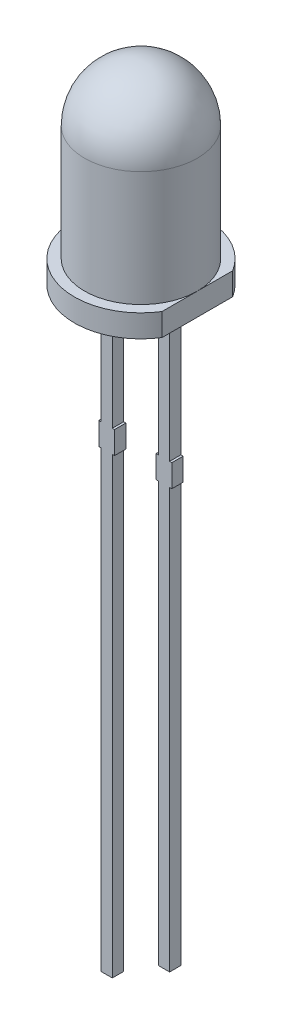
ISO-10303-21;
HEADER;
FILE_DESCRIPTION(('STEP AP214'),'2;1');
FILE_NAME('part.step','',(''),(''),'','','');
FILE_SCHEMA(('AUTOMOTIVE_DESIGN { 1 0 10303 214 1 1 1 1 }'));
ENDSEC;
DATA;
#1=APPLICATION_CONTEXT('core data for automotive mechanical design processes');
#2=APPLICATION_PROTOCOL_DEFINITION('international standard','automotive_design',2000,#1);
#3=PRODUCT_CONTEXT('',#1,'mechanical');
#4=PRODUCT('Part','Part','',(#3));
#5=PRODUCT_RELATED_PRODUCT_CATEGORY('part','',(#4));
#6=PRODUCT_DEFINITION_FORMATION('','',#4);
#7=PRODUCT_DEFINITION_CONTEXT('part definition',#1,'design');
#8=PRODUCT_DEFINITION('design','',#6,#7);
#9=PRODUCT_DEFINITION_SHAPE('','',#8);
#10=(LENGTH_UNIT() NAMED_UNIT(*) SI_UNIT(.MILLI.,.METRE.));
#11=(NAMED_UNIT(*) PLANE_ANGLE_UNIT() SI_UNIT($,.RADIAN.));
#12=(NAMED_UNIT(*) SI_UNIT($,.STERADIAN.) SOLID_ANGLE_UNIT());
#13=UNCERTAINTY_MEASURE_WITH_UNIT(LENGTH_MEASURE(1.E-05),#10,'distance_accuracy_value','');
#14=(GEOMETRIC_REPRESENTATION_CONTEXT(3) GLOBAL_UNCERTAINTY_ASSIGNED_CONTEXT((#13)) GLOBAL_UNIT_ASSIGNED_CONTEXT((#10,
#11,#12)) REPRESENTATION_CONTEXT('',''));
#15=CARTESIAN_POINT('',(0.,0.,0.));
#16=DIRECTION('',(0.,0.,1.));
#17=DIRECTION('',(1.,0.,0.));
#18=AXIS2_PLACEMENT_3D('',#15,#16,#17);
#19=CARTESIAN_POINT('',(1.02,0.,0.25));
#20=DIRECTION('',(1.,0.,0.));
#21=DIRECTION('',(0.,1.,0.));
#22=AXIS2_PLACEMENT_3D('',#19,#20,#21);
#23=PLANE('',#22);
#24=DIRECTION('',(0.,-1.,0.));
#25=VECTOR('',#24,1.);
#26=CARTESIAN_POINT('',(1.02,0.,-0.25));
#27=LINE('',#26,#25);
#28=CARTESIAN_POINT('',(1.02,0.,-0.25));
#29=VERTEX_POINT('',#28);
#30=CARTESIAN_POINT('',(1.02,-5.9,-0.25));
#31=VERTEX_POINT('',#30);
#32=EDGE_CURVE('E167',#29,#31,#27,.T.);
#33=ORIENTED_EDGE('',*,*,#32,.T.);
#34=DIRECTION('',(0.,0.,-1.));
#35=VECTOR('',#34,1.);
#36=CARTESIAN_POINT('',(1.02,-5.9,0.25));
#37=LINE('',#36,#35);
#38=CARTESIAN_POINT('',(1.02,-5.9,0.25));
#39=VERTEX_POINT('',#38);
#40=EDGE_CURVE('E12',#39,#31,#37,.T.);
#41=ORIENTED_EDGE('',*,*,#40,.F.);
#42=DIRECTION('',(0.,-1.,0.));
#43=VECTOR('',#42,1.);
#44=CARTESIAN_POINT('',(1.02,0.,0.25));
#45=LINE('',#44,#43);
#46=CARTESIAN_POINT('',(1.02,0.,0.25));
#47=VERTEX_POINT('',#46);
#48=EDGE_CURVE('E197',#47,#39,#45,.T.);
#49=ORIENTED_EDGE('',*,*,#48,.F.);
#50=DIRECTION('',(0.,0.,-1.));
#51=VECTOR('',#50,1.);
#52=CARTESIAN_POINT('',(1.02,0.,0.25));
#53=LINE('',#52,#51);
#54=EDGE_CURVE('E163',#47,#29,#53,.T.);
#55=ORIENTED_EDGE('',*,*,#54,.T.);
#56=EDGE_LOOP('',(#33,#41,#49,#55));
#57=FACE_BOUND('',#56,.T.);
#58=ADVANCED_FACE('F48',(#57),#23,.F.);
#59=CARTESIAN_POINT('',(0.,-5.9,0.25));
#60=DIRECTION('',(0.,-1.,0.));
#61=DIRECTION('',(0.,0.,-1.));
#62=AXIS2_PLACEMENT_3D('',#59,#60,#61);
#63=PLANE('',#62);
#64=DIRECTION('',(-1.,0.,0.));
#65=VECTOR('',#64,1.);
#66=CARTESIAN_POINT('',(0.,-5.9,-0.25));
#67=LINE('',#66,#65);
#68=CARTESIAN_POINT('',(0.92,-5.9,-0.25));
#69=VERTEX_POINT('',#68);
#70=EDGE_CURVE('E170',#31,#69,#67,.T.);
#71=ORIENTED_EDGE('',*,*,#70,.T.);
#72=DIRECTION('',(0.,0.,-1.));
#73=VECTOR('',#72,1.);
#74=CARTESIAN_POINT('',(0.92,-5.9,0.25));
#75=LINE('',#74,#73);
#76=CARTESIAN_POINT('',(0.92,-5.9,0.25));
#77=VERTEX_POINT('',#76);
#78=EDGE_CURVE('E56',#77,#69,#75,.T.);
#79=ORIENTED_EDGE('',*,*,#78,.F.);
#80=DIRECTION('',(-1.,0.,0.));
#81=VECTOR('',#80,1.);
#82=CARTESIAN_POINT('',(0.,-5.9,0.25));
#83=LINE('',#82,#81);
#84=EDGE_CURVE('E115',#39,#77,#83,.T.);
#85=ORIENTED_EDGE('',*,*,#84,.F.);
#86=ORIENTED_EDGE('',*,*,#40,.T.);
#87=EDGE_LOOP('',(#71,#79,#85,#86));
#88=FACE_BOUND('',#87,.T.);
#89=ADVANCED_FACE('F262',(#88),#63,.F.);
#90=CARTESIAN_POINT('',(0.92,0.,0.25));
#91=DIRECTION('',(1.,0.,0.));
#92=DIRECTION('',(0.,0.,-1.));
#93=AXIS2_PLACEMENT_3D('',#90,#91,#92);
#94=PLANE('',#93);
#95=DIRECTION('',(0.,-1.,0.));
#96=VECTOR('',#95,1.);
#97=CARTESIAN_POINT('',(0.92,0.,-0.25));
#98=LINE('',#97,#96);
#99=CARTESIAN_POINT('',(0.92,-6.9,-0.25));
#100=VERTEX_POINT('',#99);
#101=EDGE_CURVE('E172',#69,#100,#98,.T.);
#102=ORIENTED_EDGE('',*,*,#101,.T.);
#103=DIRECTION('',(0.,0.,-1.));
#104=VECTOR('',#103,1.);
#105=CARTESIAN_POINT('',(0.92,-6.9,0.25));
#106=LINE('',#105,#104);
#107=CARTESIAN_POINT('',(0.92,-6.9,0.25));
#108=VERTEX_POINT('',#107);
#109=EDGE_CURVE('E211',#108,#100,#106,.T.);
#110=ORIENTED_EDGE('',*,*,#109,.F.);
#111=DIRECTION('',(0.,-1.,0.));
#112=VECTOR('',#111,1.);
#113=CARTESIAN_POINT('',(0.92,0.,0.25));
#114=LINE('',#113,#112);
#115=EDGE_CURVE('E218',#77,#108,#114,.T.);
#116=ORIENTED_EDGE('',*,*,#115,.F.);
#117=ORIENTED_EDGE('',*,*,#78,.T.);
#118=EDGE_LOOP('',(#102,#110,#116,#117));
#119=FACE_BOUND('',#118,.T.);
#120=ADVANCED_FACE('F216',(#119),#94,.F.);
#121=CARTESIAN_POINT('',(0.,-6.9,0.25));
#122=DIRECTION('',(0.,-1.,0.));
#123=DIRECTION('',(0.,0.,-1.));
#124=AXIS2_PLACEMENT_3D('',#121,#122,#123);
#125=PLANE('',#124);
#126=DIRECTION('',(-1.,0.,0.));
#127=VECTOR('',#126,1.);
#128=CARTESIAN_POINT('',(0.,-6.9,-0.25));
#129=LINE('',#128,#127);
#130=CARTESIAN_POINT('',(1.02,-6.9,-0.25));
#131=VERTEX_POINT('',#130);
#132=EDGE_CURVE('E175',#131,#100,#129,.T.);
#133=ORIENTED_EDGE('',*,*,#132,.F.);
#134=DIRECTION('',(0.,0.,-1.));
#135=VECTOR('',#134,1.);
#136=CARTESIAN_POINT('',(1.02,-6.9,0.25));
#137=LINE('',#136,#135);
#138=CARTESIAN_POINT('',(1.02,-6.9,0.25));
#139=VERTEX_POINT('',#138);
#140=EDGE_CURVE('E209',#139,#131,#137,.T.);
#141=ORIENTED_EDGE('',*,*,#140,.F.);
#142=DIRECTION('',(-1.,0.,0.));
#143=VECTOR('',#142,1.);
#144=CARTESIAN_POINT('',(0.,-6.9,0.25));
#145=LINE('',#144,#143);
#146=EDGE_CURVE('E229',#139,#108,#145,.T.);
#147=ORIENTED_EDGE('',*,*,#146,.T.);
#148=ORIENTED_EDGE('',*,*,#109,.T.);
#149=EDGE_LOOP('',(#133,#141,#147,#148));
#150=FACE_BOUND('',#149,.T.);
#151=ADVANCED_FACE('F225',(#150),#125,.T.);
#152=CARTESIAN_POINT('',(1.02,0.,0.25));
#153=DIRECTION('',(1.,0.,0.));
#154=DIRECTION('',(0.,1.,0.));
#155=AXIS2_PLACEMENT_3D('',#152,#153,#154);
#156=PLANE('',#155);
#157=DIRECTION('',(0.,-1.,0.));
#158=VECTOR('',#157,1.);
#159=CARTESIAN_POINT('',(1.02,0.,-0.25));
#160=LINE('',#159,#158);
#161=CARTESIAN_POINT('',(1.02,-25.5,-0.25));
#162=VERTEX_POINT('',#161);
#163=EDGE_CURVE('E178',#131,#162,#160,.T.);
#164=ORIENTED_EDGE('',*,*,#163,.T.);
#165=DIRECTION('',(0.,0.,-1.));
#166=VECTOR('',#165,1.);
#167=CARTESIAN_POINT('',(1.02,-25.5,0.25));
#168=LINE('',#167,#166);
#169=CARTESIAN_POINT('',(1.02,-25.5,0.25));
#170=VERTEX_POINT('',#169);
#171=EDGE_CURVE('E207',#170,#162,#168,.T.);
#172=ORIENTED_EDGE('',*,*,#171,.F.);
#173=DIRECTION('',(0.,-1.,0.));
#174=VECTOR('',#173,1.);
#175=CARTESIAN_POINT('',(1.02,0.,0.25));
#176=LINE('',#175,#174);
#177=EDGE_CURVE('E230',#139,#170,#176,.T.);
#178=ORIENTED_EDGE('',*,*,#177,.F.);
#179=ORIENTED_EDGE('',*,*,#140,.T.);
#180=EDGE_LOOP('',(#164,#172,#178,#179));
#181=FACE_BOUND('',#180,.T.);
#182=ADVANCED_FACE('F273',(#181),#156,.F.);
#183=CARTESIAN_POINT('',(0.,-25.5,0.25));
#184=DIRECTION('',(0.,-1.,0.));
#185=DIRECTION('',(0.,0.,-1.));
#186=AXIS2_PLACEMENT_3D('',#183,#184,#185);
#187=PLANE('',#186);
#188=DIRECTION('',(-1.,0.,0.));
#189=VECTOR('',#188,1.);
#190=CARTESIAN_POINT('',(0.,-25.5,-0.25));
#191=LINE('',#190,#189);
#192=CARTESIAN_POINT('',(1.52,-25.5,-0.25));
#193=VERTEX_POINT('',#192);
#194=EDGE_CURVE('E181',#193,#162,#191,.T.);
#195=ORIENTED_EDGE('',*,*,#194,.F.);
#196=DIRECTION('',(0.,0.,-1.));
#197=VECTOR('',#196,1.);
#198=CARTESIAN_POINT('',(1.52,-25.5,0.25));
#199=LINE('',#198,#197);
#200=CARTESIAN_POINT('',(1.52,-25.5,0.25));
#201=VERTEX_POINT('',#200);
#202=EDGE_CURVE('E205',#201,#193,#199,.T.);
#203=ORIENTED_EDGE('',*,*,#202,.F.);
#204=DIRECTION('',(-1.,0.,0.));
#205=VECTOR('',#204,1.);
#206=CARTESIAN_POINT('',(0.,-25.5,0.25));
#207=LINE('',#206,#205);
#208=EDGE_CURVE('E232',#201,#170,#207,.T.);
#209=ORIENTED_EDGE('',*,*,#208,.T.);
#210=ORIENTED_EDGE('',*,*,#171,.T.);
#211=EDGE_LOOP('',(#195,#203,#209,#210));
#212=FACE_BOUND('',#211,.T.);
#213=ADVANCED_FACE('F276',(#212),#187,.T.);
#214=CARTESIAN_POINT('',(1.52,0.,0.25));
#215=DIRECTION('',(1.,0.,0.));
#216=DIRECTION('',(0.,1.,0.));
#217=AXIS2_PLACEMENT_3D('',#214,#215,#216);
#218=PLANE('',#217);
#219=DIRECTION('',(0.,-1.,0.));
#220=VECTOR('',#219,1.);
#221=CARTESIAN_POINT('',(1.52,0.,-0.25));
#222=LINE('',#221,#220);
#223=CARTESIAN_POINT('',(1.52,-6.9,-0.25));
#224=VERTEX_POINT('',#223);
#225=EDGE_CURVE('E184',#224,#193,#222,.T.);
#226=ORIENTED_EDGE('',*,*,#225,.F.);
#227=DIRECTION('',(0.,0.,-1.));
#228=VECTOR('',#227,1.);
#229=CARTESIAN_POINT('',(1.52,-6.9,0.25));
#230=LINE('',#229,#228);
#231=CARTESIAN_POINT('',(1.52,-6.9,0.25));
#232=VERTEX_POINT('',#231);
#233=EDGE_CURVE('E203',#232,#224,#230,.T.);
#234=ORIENTED_EDGE('',*,*,#233,.F.);
#235=DIRECTION('',(0.,-1.,0.));
#236=VECTOR('',#235,1.);
#237=CARTESIAN_POINT('',(1.52,0.,0.25));
#238=LINE('',#237,#236);
#239=EDGE_CURVE('E239',#232,#201,#238,.T.);
#240=ORIENTED_EDGE('',*,*,#239,.T.);
#241=ORIENTED_EDGE('',*,*,#202,.T.);
#242=EDGE_LOOP('',(#226,#234,#240,#241));
#243=FACE_BOUND('',#242,.T.);
#244=ADVANCED_FACE('F280',(#243),#218,.T.);
#245=CARTESIAN_POINT('',(0.,-6.9,0.25));
#246=DIRECTION('',(0.,-1.,0.));
#247=DIRECTION('',(0.,0.,-1.));
#248=AXIS2_PLACEMENT_3D('',#245,#246,#247);
#249=PLANE('',#248);
#250=DIRECTION('',(-1.,0.,0.));
#251=VECTOR('',#250,1.);
#252=CARTESIAN_POINT('',(0.,-6.9,-0.25));
#253=LINE('',#252,#251);
#254=CARTESIAN_POINT('',(1.62,-6.9,-0.25));
#255=VERTEX_POINT('',#254);
#256=EDGE_CURVE('E187',#255,#224,#253,.T.);
#257=ORIENTED_EDGE('',*,*,#256,.F.);
#258=DIRECTION('',(0.,0.,-1.));
#259=VECTOR('',#258,1.);
#260=CARTESIAN_POINT('',(1.62,-6.9,0.25));
#261=LINE('',#260,#259);
#262=CARTESIAN_POINT('',(1.62,-6.9,0.25));
#263=VERTEX_POINT('',#262);
#264=EDGE_CURVE('E201',#263,#255,#261,.T.);
#265=ORIENTED_EDGE('',*,*,#264,.F.);
#266=DIRECTION('',(-1.,0.,0.));
#267=VECTOR('',#266,1.);
#268=CARTESIAN_POINT('',(0.,-6.9,0.25));
#269=LINE('',#268,#267);
#270=EDGE_CURVE('E242',#263,#232,#269,.T.);
#271=ORIENTED_EDGE('',*,*,#270,.T.);
#272=ORIENTED_EDGE('',*,*,#233,.T.);
#273=EDGE_LOOP('',(#257,#265,#271,#272));
#274=FACE_BOUND('',#273,.T.);
#275=ADVANCED_FACE('F284',(#274),#249,.T.);
#276=CARTESIAN_POINT('',(1.61999999999999,0.,0.25));
#277=DIRECTION('',(1.,0.,0.));
#278=DIRECTION('',(0.,1.,0.));
#279=AXIS2_PLACEMENT_3D('',#276,#277,#278);
#280=PLANE('',#279);
#281=DIRECTION('',(0.,-1.,0.));
#282=VECTOR('',#281,1.);
#283=CARTESIAN_POINT('',(1.61999999999999,0.,-0.25));
#284=LINE('',#283,#282);
#285=CARTESIAN_POINT('',(1.62,-5.9,-0.25));
#286=VERTEX_POINT('',#285);
#287=EDGE_CURVE('E190',#286,#255,#284,.T.);
#288=ORIENTED_EDGE('',*,*,#287,.F.);
#289=DIRECTION('',(0.,0.,-1.));
#290=VECTOR('',#289,1.);
#291=CARTESIAN_POINT('',(1.62,-5.9,0.25));
#292=LINE('',#291,#290);
#293=CARTESIAN_POINT('',(1.62,-5.9,0.25));
#294=VERTEX_POINT('',#293);
#295=EDGE_CURVE('E159',#294,#286,#292,.T.);
#296=ORIENTED_EDGE('',*,*,#295,.F.);
#297=DIRECTION('',(0.,-1.,0.));
#298=VECTOR('',#297,1.);
#299=CARTESIAN_POINT('',(1.61999999999999,0.,0.25));
#300=LINE('',#299,#298);
#301=EDGE_CURVE('E148',#294,#263,#300,.T.);
#302=ORIENTED_EDGE('',*,*,#301,.T.);
#303=ORIENTED_EDGE('',*,*,#264,.T.);
#304=EDGE_LOOP('',(#288,#296,#302,#303));
#305=FACE_BOUND('',#304,.T.);
#306=ADVANCED_FACE('F246',(#305),#280,.T.);
#307=CARTESIAN_POINT('',(0.,-5.9,0.25));
#308=DIRECTION('',(0.,-1.,0.));
#309=DIRECTION('',(0.,0.,-1.));
#310=AXIS2_PLACEMENT_3D('',#307,#308,#309);
#311=PLANE('',#310);
#312=DIRECTION('',(-1.,0.,0.));
#313=VECTOR('',#312,1.);
#314=CARTESIAN_POINT('',(0.,-5.9,-0.25));
#315=LINE('',#314,#313);
#316=CARTESIAN_POINT('',(1.52,-5.9,-0.25));
#317=VERTEX_POINT('',#316);
#318=EDGE_CURVE('E155',#286,#317,#315,.T.);
#319=ORIENTED_EDGE('',*,*,#318,.T.);
#320=DIRECTION('',(0.,0.,-1.));
#321=VECTOR('',#320,1.);
#322=CARTESIAN_POINT('',(1.52,-5.9,0.25));
#323=LINE('',#322,#321);
#324=CARTESIAN_POINT('',(1.52,-5.9,0.25));
#325=VERTEX_POINT('',#324);
#326=EDGE_CURVE('E152',#325,#317,#323,.T.);
#327=ORIENTED_EDGE('',*,*,#326,.F.);
#328=DIRECTION('',(-1.,0.,0.));
#329=VECTOR('',#328,1.);
#330=CARTESIAN_POINT('',(0.,-5.9,0.25));
#331=LINE('',#330,#329);
#332=EDGE_CURVE('E141',#294,#325,#331,.T.);
#333=ORIENTED_EDGE('',*,*,#332,.F.);
#334=ORIENTED_EDGE('',*,*,#295,.T.);
#335=EDGE_LOOP('',(#319,#327,#333,#334));
#336=FACE_BOUND('',#335,.T.);
#337=ADVANCED_FACE('F153',(#336),#311,.F.);
#338=CARTESIAN_POINT('',(1.52,0.,0.25));
#339=DIRECTION('',(1.,0.,0.));
#340=DIRECTION('',(0.,1.,0.));
#341=AXIS2_PLACEMENT_3D('',#338,#339,#340);
#342=PLANE('',#341);
#343=DIRECTION('',(0.,-1.,0.));
#344=VECTOR('',#343,1.);
#345=CARTESIAN_POINT('',(1.52,0.,-0.25));
#346=LINE('',#345,#344);
#347=CARTESIAN_POINT('',(1.52,0.,-0.25));
#348=VERTEX_POINT('',#347);
#349=EDGE_CURVE('E194',#348,#317,#346,.T.);
#350=ORIENTED_EDGE('',*,*,#349,.F.);
#351=DIRECTION('',(0.,0.,-1.));
#352=VECTOR('',#351,1.);
#353=CARTESIAN_POINT('',(1.52,0.,0.25));
#354=LINE('',#353,#352);
#355=CARTESIAN_POINT('',(1.52,0.,0.25));
#356=VERTEX_POINT('',#355);
#357=EDGE_CURVE('E104',#356,#348,#354,.T.);
#358=ORIENTED_EDGE('',*,*,#357,.F.);
#359=DIRECTION('',(0.,-1.,0.));
#360=VECTOR('',#359,1.);
#361=CARTESIAN_POINT('',(1.52,0.,0.25));
#362=LINE('',#361,#360);
#363=EDGE_CURVE('E145',#356,#325,#362,.T.);
#364=ORIENTED_EDGE('',*,*,#363,.T.);
#365=ORIENTED_EDGE('',*,*,#326,.T.);
#366=EDGE_LOOP('',(#350,#358,#364,#365));
#367=FACE_BOUND('',#366,.T.);
#368=ADVANCED_FACE('F161',(#367),#342,.T.);
#369=CARTESIAN_POINT('',(0.,0.,0.25));
#370=DIRECTION('',(0.,-1.,0.));
#371=DIRECTION('',(1.,0.,0.));
#372=AXIS2_PLACEMENT_3D('',#369,#370,#371);
#373=PLANE('',#372);
#374=DIRECTION('',(-1.,0.,0.));
#375=VECTOR('',#374,1.);
#376=CARTESIAN_POINT('',(0.,0.,-0.25));
#377=LINE('',#376,#375);
#378=EDGE_CURVE('E107',#348,#29,#377,.T.);
#379=ORIENTED_EDGE('',*,*,#378,.T.);
#380=ORIENTED_EDGE('',*,*,#54,.F.);
#381=DIRECTION('',(-1.,0.,0.));
#382=VECTOR('',#381,1.);
#383=CARTESIAN_POINT('',(0.,0.,0.25));
#384=LINE('',#383,#382);
#385=EDGE_CURVE('E64',#356,#47,#384,.T.);
#386=ORIENTED_EDGE('',*,*,#385,.F.);
#387=ORIENTED_EDGE('',*,*,#357,.T.);
#388=EDGE_LOOP('',(#379,#380,#386,#387));
#389=FACE_BOUND('',#388,.T.);
#390=ADVANCED_FACE('F251',(#389),#373,.F.);
#391=CARTESIAN_POINT('',(0.,0.,0.25));
#392=DIRECTION('',(0.,0.,1.));
#393=DIRECTION('',(1.,0.,0.));
#394=AXIS2_PLACEMENT_3D('',#391,#392,#393);
#395=PLANE('',#394);
#396=ORIENTED_EDGE('',*,*,#48,.T.);
#397=ORIENTED_EDGE('',*,*,#84,.T.);
#398=ORIENTED_EDGE('',*,*,#115,.T.);
#399=ORIENTED_EDGE('',*,*,#146,.F.);
#400=ORIENTED_EDGE('',*,*,#177,.T.);
#401=ORIENTED_EDGE('',*,*,#208,.F.);
#402=ORIENTED_EDGE('',*,*,#239,.F.);
#403=ORIENTED_EDGE('',*,*,#270,.F.);
#404=ORIENTED_EDGE('',*,*,#301,.F.);
#405=ORIENTED_EDGE('',*,*,#332,.T.);
#406=ORIENTED_EDGE('',*,*,#363,.F.);
#407=ORIENTED_EDGE('',*,*,#385,.T.);
#408=EDGE_LOOP('',(#396,#397,#398,#399,#400,#401,#402,#403,#404,#405,#406,#407));
#409=FACE_BOUND('',#408,.T.);
#410=ADVANCED_FACE('F143',(#409),#395,.T.);
#411=CARTESIAN_POINT('',(0.,0.,-0.25));
#412=DIRECTION('',(0.,0.,1.));
#413=DIRECTION('',(1.,0.,0.));
#414=AXIS2_PLACEMENT_3D('',#411,#412,#413);
#415=PLANE('',#414);
#416=ORIENTED_EDGE('',*,*,#32,.F.);
#417=ORIENTED_EDGE('',*,*,#378,.F.);
#418=ORIENTED_EDGE('',*,*,#349,.T.);
#419=ORIENTED_EDGE('',*,*,#318,.F.);
#420=ORIENTED_EDGE('',*,*,#287,.T.);
#421=ORIENTED_EDGE('',*,*,#256,.T.);
#422=ORIENTED_EDGE('',*,*,#225,.T.);
#423=ORIENTED_EDGE('',*,*,#194,.T.);
#424=ORIENTED_EDGE('',*,*,#163,.F.);
#425=ORIENTED_EDGE('',*,*,#132,.T.);
#426=ORIENTED_EDGE('',*,*,#101,.F.);
#427=ORIENTED_EDGE('',*,*,#70,.F.);
#428=EDGE_LOOP('',(#416,#417,#418,#419,#420,#421,#422,#423,#424,#425,#426,#427));
#429=FACE_BOUND('',#428,.T.);
#430=ADVANCED_FACE('F221',(#429),#415,.F.);
#431=CLOSED_SHELL('',(#58,#89,#120,#151,#182,#213,#244,#275,#306,#337,#368,#390,#410,#430));
#432=MANIFOLD_SOLID_BREP('B2',#431);
#433=CARTESIAN_POINT('',(-1.52,0.,0.25));
#434=DIRECTION('',(1.,0.,0.));
#435=DIRECTION('',(0.,1.,0.));
#436=AXIS2_PLACEMENT_3D('',#433,#434,#435);
#437=PLANE('',#436);
#438=DIRECTION('',(0.,-1.,0.));
#439=VECTOR('',#438,1.);
#440=CARTESIAN_POINT('',(-1.52,0.,-0.25));
#441=LINE('',#440,#439);
#442=CARTESIAN_POINT('',(-1.52,0.,-0.25));
#443=VERTEX_POINT('',#442);
#444=CARTESIAN_POINT('',(-1.52,-5.9,-0.25));
#445=VERTEX_POINT('',#444);
#446=EDGE_CURVE('E524',#443,#445,#441,.T.);
#447=ORIENTED_EDGE('',*,*,#446,.T.);
#448=DIRECTION('',(0.,0.,-1.));
#449=VECTOR('',#448,1.);
#450=CARTESIAN_POINT('',(-1.52,-5.9,0.25));
#451=LINE('',#450,#449);
#452=CARTESIAN_POINT('',(-1.52,-5.9,0.25));
#453=VERTEX_POINT('',#452);
#454=EDGE_CURVE('E46',#453,#445,#451,.T.);
#455=ORIENTED_EDGE('',*,*,#454,.F.);
#456=DIRECTION('',(0.,-1.,0.));
#457=VECTOR('',#456,1.);
#458=CARTESIAN_POINT('',(-1.52,0.,0.25));
#459=LINE('',#458,#457);
#460=CARTESIAN_POINT('',(-1.52,0.,0.25));
#461=VERTEX_POINT('',#460);
#462=EDGE_CURVE('E471',#461,#453,#459,.T.);
#463=ORIENTED_EDGE('',*,*,#462,.F.);
#464=DIRECTION('',(0.,0.,-1.));
#465=VECTOR('',#464,1.);
#466=CARTESIAN_POINT('',(-1.52,0.,0.25));
#467=LINE('',#466,#465);
#468=EDGE_CURVE('E520',#461,#443,#467,.T.);
#469=ORIENTED_EDGE('',*,*,#468,.T.);
#470=EDGE_LOOP('',(#447,#455,#463,#469));
#471=FACE_BOUND('',#470,.T.);
#472=ADVANCED_FACE('F407',(#471),#437,.F.);
#473=CARTESIAN_POINT('',(0.,-5.9,0.25));
#474=DIRECTION('',(0.,1.,0.));
#475=DIRECTION('',(0.,0.,1.));
#476=AXIS2_PLACEMENT_3D('',#473,#474,#475);
#477=PLANE('',#476);
#478=DIRECTION('',(1.,0.,0.));
#479=VECTOR('',#478,1.);
#480=CARTESIAN_POINT('',(0.,-5.9,-0.25));
#481=LINE('',#480,#479);
#482=CARTESIAN_POINT('',(-1.62,-5.9,-0.25));
#483=VERTEX_POINT('',#482);
#484=EDGE_CURVE('E527',#483,#445,#481,.T.);
#485=ORIENTED_EDGE('',*,*,#484,.F.);
#486=DIRECTION('',(0.,0.,-1.));
#487=VECTOR('',#486,1.);
#488=CARTESIAN_POINT('',(-1.62,-5.9,0.25));
#489=LINE('',#488,#487);
#490=CARTESIAN_POINT('',(-1.62,-5.9,0.25));
#491=VERTEX_POINT('',#490);
#492=EDGE_CURVE('E415',#491,#483,#489,.T.);
#493=ORIENTED_EDGE('',*,*,#492,.F.);
#494=DIRECTION('',(1.,0.,0.));
#495=VECTOR('',#494,1.);
#496=CARTESIAN_POINT('',(0.,-5.9,0.25));
#497=LINE('',#496,#495);
#498=EDGE_CURVE('E584',#491,#453,#497,.T.);
#499=ORIENTED_EDGE('',*,*,#498,.T.);
#500=ORIENTED_EDGE('',*,*,#454,.T.);
#501=EDGE_LOOP('',(#485,#493,#499,#500));
#502=FACE_BOUND('',#501,.T.);
#503=ADVANCED_FACE('F583',(#502),#477,.T.);
#504=CARTESIAN_POINT('',(-1.62,0.,0.25));
#505=DIRECTION('',(1.,0.,0.));
#506=DIRECTION('',(0.,1.,0.));
#507=AXIS2_PLACEMENT_3D('',#504,#505,#506);
#508=PLANE('',#507);
#509=DIRECTION('',(0.,-1.,0.));
#510=VECTOR('',#509,1.);
#511=CARTESIAN_POINT('',(-1.62,0.,-0.25));
#512=LINE('',#511,#510);
#513=CARTESIAN_POINT('',(-1.62,-6.9,-0.25));
#514=VERTEX_POINT('',#513);
#515=EDGE_CURVE('E530',#483,#514,#512,.T.);
#516=ORIENTED_EDGE('',*,*,#515,.T.);
#517=DIRECTION('',(0.,0.,-1.));
#518=VECTOR('',#517,1.);
#519=CARTESIAN_POINT('',(-1.62,-6.9,0.25));
#520=LINE('',#519,#518);
#521=CARTESIAN_POINT('',(-1.62,-6.9,0.25));
#522=VERTEX_POINT('',#521);
#523=EDGE_CURVE('E567',#522,#514,#520,.T.);
#524=ORIENTED_EDGE('',*,*,#523,.F.);
#525=DIRECTION('',(0.,-1.,0.));
#526=VECTOR('',#525,1.);
#527=CARTESIAN_POINT('',(-1.62,0.,0.25));
#528=LINE('',#527,#526);
#529=EDGE_CURVE('E574',#491,#522,#528,.T.);
#530=ORIENTED_EDGE('',*,*,#529,.F.);
#531=ORIENTED_EDGE('',*,*,#492,.T.);
#532=EDGE_LOOP('',(#516,#524,#530,#531));
#533=FACE_BOUND('',#532,.T.);
#534=ADVANCED_FACE('F572',(#533),#508,.F.);
#535=CARTESIAN_POINT('',(0.,-6.9,0.25));
#536=DIRECTION('',(0.,1.,0.));
#537=DIRECTION('',(0.,0.,1.));
#538=AXIS2_PLACEMENT_3D('',#535,#536,#537);
#539=PLANE('',#538);
#540=DIRECTION('',(1.,0.,0.));
#541=VECTOR('',#540,1.);
#542=CARTESIAN_POINT('',(0.,-6.9,-0.25));
#543=LINE('',#542,#541);
#544=CARTESIAN_POINT('',(-1.52,-6.9,-0.25));
#545=VERTEX_POINT('',#544);
#546=EDGE_CURVE('E532',#514,#545,#543,.T.);
#547=ORIENTED_EDGE('',*,*,#546,.T.);
#548=DIRECTION('',(0.,0.,-1.));
#549=VECTOR('',#548,1.);
#550=CARTESIAN_POINT('',(-1.52,-6.9,0.25));
#551=LINE('',#550,#549);
#552=CARTESIAN_POINT('',(-1.52,-6.9,0.25));
#553=VERTEX_POINT('',#552);
#554=EDGE_CURVE('E564',#553,#545,#551,.T.);
#555=ORIENTED_EDGE('',*,*,#554,.F.);
#556=DIRECTION('',(1.,0.,0.));
#557=VECTOR('',#556,1.);
#558=CARTESIAN_POINT('',(0.,-6.9,0.25));
#559=LINE('',#558,#557);
#560=EDGE_CURVE('E616',#522,#553,#559,.T.);
#561=ORIENTED_EDGE('',*,*,#560,.F.);
#562=ORIENTED_EDGE('',*,*,#523,.T.);
#563=EDGE_LOOP('',(#547,#555,#561,#562));
#564=FACE_BOUND('',#563,.T.);
#565=ADVANCED_FACE('F615',(#564),#539,.F.);
#566=CARTESIAN_POINT('',(-1.52,0.,0.25));
#567=DIRECTION('',(1.,0.,0.));
#568=DIRECTION('',(0.,1.,0.));
#569=AXIS2_PLACEMENT_3D('',#566,#567,#568);
#570=PLANE('',#569);
#571=DIRECTION('',(0.,-1.,0.));
#572=VECTOR('',#571,1.);
#573=CARTESIAN_POINT('',(-1.52,0.,-0.25));
#574=LINE('',#573,#572);
#575=CARTESIAN_POINT('',(-1.52,-27.,-0.25));
#576=VERTEX_POINT('',#575);
#577=EDGE_CURVE('E534',#545,#576,#574,.T.);
#578=ORIENTED_EDGE('',*,*,#577,.T.);
#579=DIRECTION('',(0.,0.,-1.));
#580=VECTOR('',#579,1.);
#581=CARTESIAN_POINT('',(-1.52,-27.,0.25));
#582=LINE('',#581,#580);
#583=CARTESIAN_POINT('',(-1.52,-27.,0.25));
#584=VERTEX_POINT('',#583);
#585=EDGE_CURVE('E562',#584,#576,#582,.T.);
#586=ORIENTED_EDGE('',*,*,#585,.F.);
#587=DIRECTION('',(0.,-1.,0.));
#588=VECTOR('',#587,1.);
#589=CARTESIAN_POINT('',(-1.52,0.,0.25));
#590=LINE('',#589,#588);
#591=EDGE_CURVE('E612',#553,#584,#590,.T.);
#592=ORIENTED_EDGE('',*,*,#591,.F.);
#593=ORIENTED_EDGE('',*,*,#554,.T.);
#594=EDGE_LOOP('',(#578,#586,#592,#593));
#595=FACE_BOUND('',#594,.T.);
#596=ADVANCED_FACE('F610',(#595),#570,.F.);
#597=CARTESIAN_POINT('',(0.,-27.,0.25));
#598=DIRECTION('',(0.,-1.,0.));
#599=DIRECTION('',(0.,0.,-1.));
#600=AXIS2_PLACEMENT_3D('',#597,#598,#599);
#601=PLANE('',#600);
#602=DIRECTION('',(-1.,0.,0.));
#603=VECTOR('',#602,1.);
#604=CARTESIAN_POINT('',(0.,-27.,-0.25));
#605=LINE('',#604,#603);
#606=CARTESIAN_POINT('',(-1.02,-27.,-0.25));
#607=VERTEX_POINT('',#606);
#608=EDGE_CURVE('E537',#607,#576,#605,.T.);
#609=ORIENTED_EDGE('',*,*,#608,.F.);
#610=DIRECTION('',(0.,0.,-1.));
#611=VECTOR('',#610,1.);
#612=CARTESIAN_POINT('',(-1.02,-27.,0.25));
#613=LINE('',#612,#611);
#614=CARTESIAN_POINT('',(-1.02,-27.,0.25));
#615=VERTEX_POINT('',#614);
#616=EDGE_CURVE('E560',#615,#607,#613,.T.);
#617=ORIENTED_EDGE('',*,*,#616,.F.);
#618=DIRECTION('',(-1.,0.,0.));
#619=VECTOR('',#618,1.);
#620=CARTESIAN_POINT('',(0.,-27.,0.25));
#621=LINE('',#620,#619);
#622=EDGE_CURVE('E607',#615,#584,#621,.T.);
#623=ORIENTED_EDGE('',*,*,#622,.T.);
#624=ORIENTED_EDGE('',*,*,#585,.T.);
#625=EDGE_LOOP('',(#609,#617,#623,#624));
#626=FACE_BOUND('',#625,.T.);
#627=ADVANCED_FACE('F603',(#626),#601,.T.);
#628=CARTESIAN_POINT('',(-1.02,0.,0.25));
#629=DIRECTION('',(1.,0.,0.));
#630=DIRECTION('',(0.,1.,0.));
#631=AXIS2_PLACEMENT_3D('',#628,#629,#630);
#632=PLANE('',#631);
#633=DIRECTION('',(0.,-1.,0.));
#634=VECTOR('',#633,1.);
#635=CARTESIAN_POINT('',(-1.02,0.,-0.25));
#636=LINE('',#635,#634);
#637=CARTESIAN_POINT('',(-1.02,-6.9,-0.25));
#638=VERTEX_POINT('',#637);
#639=EDGE_CURVE('E540',#638,#607,#636,.T.);
#640=ORIENTED_EDGE('',*,*,#639,.F.);
#641=DIRECTION('',(0.,0.,-1.));
#642=VECTOR('',#641,1.);
#643=CARTESIAN_POINT('',(-1.02,-6.9,0.25));
#644=LINE('',#643,#642);
#645=CARTESIAN_POINT('',(-1.02,-6.9,0.25));
#646=VERTEX_POINT('',#645);
#647=EDGE_CURVE('E558',#646,#638,#644,.T.);
#648=ORIENTED_EDGE('',*,*,#647,.F.);
#649=DIRECTION('',(0.,-1.,0.));
#650=VECTOR('',#649,1.);
#651=CARTESIAN_POINT('',(-1.02,0.,0.25));
#652=LINE('',#651,#650);
#653=EDGE_CURVE('E600',#646,#615,#652,.T.);
#654=ORIENTED_EDGE('',*,*,#653,.T.);
#655=ORIENTED_EDGE('',*,*,#616,.T.);
#656=EDGE_LOOP('',(#640,#648,#654,#655));
#657=FACE_BOUND('',#656,.T.);
#658=ADVANCED_FACE('F599',(#657),#632,.T.);
#659=CARTESIAN_POINT('',(0.,-6.9,0.25));
#660=DIRECTION('',(0.,1.,0.));
#661=DIRECTION('',(0.,0.,1.));
#662=AXIS2_PLACEMENT_3D('',#659,#660,#661);
#663=PLANE('',#662);
#664=DIRECTION('',(1.,0.,0.));
#665=VECTOR('',#664,1.);
#666=CARTESIAN_POINT('',(0.,-6.9,-0.25));
#667=LINE('',#666,#665);
#668=CARTESIAN_POINT('',(-0.919999999999998,-6.9,-0.25));
#669=VERTEX_POINT('',#668);
#670=EDGE_CURVE('E543',#638,#669,#667,.T.);
#671=ORIENTED_EDGE('',*,*,#670,.T.);
#672=DIRECTION('',(0.,0.,-1.));
#673=VECTOR('',#672,1.);
#674=CARTESIAN_POINT('',(-0.919999999999998,-6.9,0.25));
#675=LINE('',#674,#673);
#676=CARTESIAN_POINT('',(-0.919999999999998,-6.9,0.25));
#677=VERTEX_POINT('',#676);
#678=EDGE_CURVE('E556',#677,#669,#675,.T.);
#679=ORIENTED_EDGE('',*,*,#678,.F.);
#680=DIRECTION('',(1.,0.,0.));
#681=VECTOR('',#680,1.);
#682=CARTESIAN_POINT('',(0.,-6.9,0.25));
#683=LINE('',#682,#681);
#684=EDGE_CURVE('E595',#646,#677,#683,.T.);
#685=ORIENTED_EDGE('',*,*,#684,.F.);
#686=ORIENTED_EDGE('',*,*,#647,.T.);
#687=EDGE_LOOP('',(#671,#679,#685,#686));
#688=FACE_BOUND('',#687,.T.);
#689=ADVANCED_FACE('F594',(#688),#663,.F.);
#690=CARTESIAN_POINT('',(-0.92000000000001,0.,0.25));
#691=DIRECTION('',(1.,0.,0.));
#692=DIRECTION('',(0.,1.,0.));
#693=AXIS2_PLACEMENT_3D('',#690,#691,#692);
#694=PLANE('',#693);
#695=DIRECTION('',(0.,-1.,0.));
#696=VECTOR('',#695,1.);
#697=CARTESIAN_POINT('',(-0.92000000000001,0.,-0.25));
#698=LINE('',#697,#696);
#699=CARTESIAN_POINT('',(-0.92,-5.9,-0.25));
#700=VERTEX_POINT('',#699);
#701=EDGE_CURVE('E546',#700,#669,#698,.T.);
#702=ORIENTED_EDGE('',*,*,#701,.F.);
#703=DIRECTION('',(0.,0.,-1.));
#704=VECTOR('',#703,1.);
#705=CARTESIAN_POINT('',(-0.92,-5.9,0.25));
#706=LINE('',#705,#704);
#707=CARTESIAN_POINT('',(-0.92,-5.9,0.25));
#708=VERTEX_POINT('',#707);
#709=EDGE_CURVE('E510',#708,#700,#706,.T.);
#710=ORIENTED_EDGE('',*,*,#709,.F.);
#711=DIRECTION('',(0.,-1.,0.));
#712=VECTOR('',#711,1.);
#713=CARTESIAN_POINT('',(-0.92000000000001,0.,0.25));
#714=LINE('',#713,#712);
#715=EDGE_CURVE('E516',#708,#677,#714,.T.);
#716=ORIENTED_EDGE('',*,*,#715,.T.);
#717=ORIENTED_EDGE('',*,*,#678,.T.);
#718=EDGE_LOOP('',(#702,#710,#716,#717));
#719=FACE_BOUND('',#718,.T.);
#720=ADVANCED_FACE('F590',(#719),#694,.T.);
#721=CARTESIAN_POINT('',(0.,-5.9,0.25));
#722=DIRECTION('',(0.,1.,0.));
#723=DIRECTION('',(0.,0.,1.));
#724=AXIS2_PLACEMENT_3D('',#721,#722,#723);
#725=PLANE('',#724);
#726=DIRECTION('',(1.,0.,0.));
#727=VECTOR('',#726,1.);
#728=CARTESIAN_POINT('',(0.,-5.9,-0.25));
#729=LINE('',#728,#727);
#730=CARTESIAN_POINT('',(-1.02,-5.9,-0.25));
#731=VERTEX_POINT('',#730);
#732=EDGE_CURVE('E505',#731,#700,#729,.T.);
#733=ORIENTED_EDGE('',*,*,#732,.F.);
#734=DIRECTION('',(0.,0.,-1.));
#735=VECTOR('',#734,1.);
#736=CARTESIAN_POINT('',(-1.02,-5.9,0.25));
#737=LINE('',#736,#735);
#738=CARTESIAN_POINT('',(-1.02,-5.9,0.25));
#739=VERTEX_POINT('',#738);
#740=EDGE_CURVE('E500',#739,#731,#737,.T.);
#741=ORIENTED_EDGE('',*,*,#740,.F.);
#742=DIRECTION('',(1.,0.,0.));
#743=VECTOR('',#742,1.);
#744=CARTESIAN_POINT('',(0.,-5.9,0.25));
#745=LINE('',#744,#743);
#746=EDGE_CURVE('E503',#739,#708,#745,.T.);
#747=ORIENTED_EDGE('',*,*,#746,.T.);
#748=ORIENTED_EDGE('',*,*,#709,.T.);
#749=EDGE_LOOP('',(#733,#741,#747,#748));
#750=FACE_BOUND('',#749,.T.);
#751=ADVANCED_FACE('F502',(#750),#725,.T.);
#752=CARTESIAN_POINT('',(-1.02,0.,0.25));
#753=DIRECTION('',(1.,0.,0.));
#754=DIRECTION('',(0.,1.,0.));
#755=AXIS2_PLACEMENT_3D('',#752,#753,#754);
#756=PLANE('',#755);
#757=DIRECTION('',(0.,-1.,0.));
#758=VECTOR('',#757,1.);
#759=CARTESIAN_POINT('',(-1.02,0.,-0.25));
#760=LINE('',#759,#758);
#761=CARTESIAN_POINT('',(-1.02,0.,-0.25));
#762=VERTEX_POINT('',#761);
#763=EDGE_CURVE('E550',#762,#731,#760,.T.);
#764=ORIENTED_EDGE('',*,*,#763,.F.);
#765=DIRECTION('',(0.,0.,-1.));
#766=VECTOR('',#765,1.);
#767=CARTESIAN_POINT('',(-1.02,0.,0.25));
#768=LINE('',#767,#766);
#769=CARTESIAN_POINT('',(-1.02,0.,0.25));
#770=VERTEX_POINT('',#769);
#771=EDGE_CURVE('E462',#770,#762,#768,.T.);
#772=ORIENTED_EDGE('',*,*,#771,.F.);
#773=DIRECTION('',(0.,-1.,0.));
#774=VECTOR('',#773,1.);
#775=CARTESIAN_POINT('',(-1.02,0.,0.25));
#776=LINE('',#775,#774);
#777=EDGE_CURVE('E514',#770,#739,#776,.T.);
#778=ORIENTED_EDGE('',*,*,#777,.T.);
#779=ORIENTED_EDGE('',*,*,#740,.T.);
#780=EDGE_LOOP('',(#764,#772,#778,#779));
#781=FACE_BOUND('',#780,.T.);
#782=ADVANCED_FACE('F518',(#781),#756,.T.);
#783=CARTESIAN_POINT('',(0.,0.,0.25));
#784=DIRECTION('',(0.,-1.,0.));
#785=DIRECTION('',(1.,0.,0.));
#786=AXIS2_PLACEMENT_3D('',#783,#784,#785);
#787=PLANE('',#786);
#788=DIRECTION('',(-1.,0.,0.));
#789=VECTOR('',#788,1.);
#790=CARTESIAN_POINT('',(0.,0.,-0.25));
#791=LINE('',#790,#789);
#792=EDGE_CURVE('E465',#762,#443,#791,.T.);
#793=ORIENTED_EDGE('',*,*,#792,.T.);
#794=ORIENTED_EDGE('',*,*,#468,.F.);
#795=DIRECTION('',(-1.,0.,0.));
#796=VECTOR('',#795,1.);
#797=CARTESIAN_POINT('',(0.,0.,0.25));
#798=LINE('',#797,#796);
#799=EDGE_CURVE('E423',#770,#461,#798,.T.);
#800=ORIENTED_EDGE('',*,*,#799,.F.);
#801=ORIENTED_EDGE('',*,*,#771,.T.);
#802=EDGE_LOOP('',(#793,#794,#800,#801));
#803=FACE_BOUND('',#802,.T.);
#804=ADVANCED_FACE('F702',(#803),#787,.F.);
#805=CARTESIAN_POINT('',(0.,0.,0.25));
#806=DIRECTION('',(0.,0.,1.));
#807=DIRECTION('',(1.,0.,0.));
#808=AXIS2_PLACEMENT_3D('',#805,#806,#807);
#809=PLANE('',#808);
#810=ORIENTED_EDGE('',*,*,#462,.T.);
#811=ORIENTED_EDGE('',*,*,#498,.F.);
#812=ORIENTED_EDGE('',*,*,#529,.T.);
#813=ORIENTED_EDGE('',*,*,#560,.T.);
#814=ORIENTED_EDGE('',*,*,#591,.T.);
#815=ORIENTED_EDGE('',*,*,#622,.F.);
#816=ORIENTED_EDGE('',*,*,#653,.F.);
#817=ORIENTED_EDGE('',*,*,#684,.T.);
#818=ORIENTED_EDGE('',*,*,#715,.F.);
#819=ORIENTED_EDGE('',*,*,#746,.F.);
#820=ORIENTED_EDGE('',*,*,#777,.F.);
#821=ORIENTED_EDGE('',*,*,#799,.T.);
#822=EDGE_LOOP('',(#810,#811,#812,#813,#814,#815,#816,#817,#818,#819,#820,#821));
#823=FACE_BOUND('',#822,.T.);
#824=ADVANCED_FACE('F513',(#823),#809,.T.);
#825=CARTESIAN_POINT('',(0.,0.,-0.25));
#826=DIRECTION('',(0.,0.,1.));
#827=DIRECTION('',(1.,0.,0.));
#828=AXIS2_PLACEMENT_3D('',#825,#826,#827);
#829=PLANE('',#828);
#830=ORIENTED_EDGE('',*,*,#446,.F.);
#831=ORIENTED_EDGE('',*,*,#792,.F.);
#832=ORIENTED_EDGE('',*,*,#763,.T.);
#833=ORIENTED_EDGE('',*,*,#732,.T.);
#834=ORIENTED_EDGE('',*,*,#701,.T.);
#835=ORIENTED_EDGE('',*,*,#670,.F.);
#836=ORIENTED_EDGE('',*,*,#639,.T.);
#837=ORIENTED_EDGE('',*,*,#608,.T.);
#838=ORIENTED_EDGE('',*,*,#577,.F.);
#839=ORIENTED_EDGE('',*,*,#546,.F.);
#840=ORIENTED_EDGE('',*,*,#515,.F.);
#841=ORIENTED_EDGE('',*,*,#484,.T.);
#842=EDGE_LOOP('',(#830,#831,#832,#833,#834,#835,#836,#837,#838,#839,#840,#841));
#843=FACE_BOUND('',#842,.T.);
#844=ADVANCED_FACE('F581',(#843),#829,.F.);
#845=CLOSED_SHELL('',(#472,#503,#534,#565,#596,#627,#658,#689,#720,#751,#782,#804,#824,#844));
#846=MANIFOLD_SOLID_BREP('B6',#845);
#847=CARTESIAN_POINT('',(0.,1.,0.));
#848=DIRECTION('',(0.,1.,0.));
#849=DIRECTION('',(0.,0.,1.));
#850=AXIS2_PLACEMENT_3D('',#847,#848,#849);
#851=PLANE('',#850);
#852=DIRECTION('',(0.,0.,1.));
#853=VECTOR('',#852,1.);
#854=CARTESIAN_POINT('',(2.5,1.,0.));
#855=LINE('',#854,#853);
#856=CARTESIAN_POINT('',(2.5,1.,0.));
#857=VERTEX_POINT('',#856);
#858=CARTESIAN_POINT('',(2.5,1.,1.56604597633658));
#859=VERTEX_POINT('',#858);
#860=EDGE_CURVE('E778',#857,#859,#855,.T.);
#861=ORIENTED_EDGE('',*,*,#860,.F.);
#862=CARTESIAN_POINT('',(0.,1.,0.));
#863=DIRECTION('',(0.,-1.,0.));
#864=DIRECTION('',(1.,0.,0.));
#865=AXIS2_PLACEMENT_3D('',#862,#863,#864);
#866=CIRCLE('',#865,2.5);
#867=EDGE_CURVE('E770',#857,#857,#866,.T.);
#868=ORIENTED_EDGE('',*,*,#867,.T.);
#869=CARTESIAN_POINT('',(2.5,1.,-1.56604597633658));
#870=VERTEX_POINT('',#869);
#871=EDGE_CURVE('E804',#870,#857,#855,.T.);
#872=ORIENTED_EDGE('',*,*,#871,.F.);
#873=CARTESIAN_POINT('',(0.,1.,0.));
#874=DIRECTION('',(0.,1.,0.));
#875=DIRECTION('',(0.,0.,1.));
#876=AXIS2_PLACEMENT_3D('',#873,#874,#875);
#877=CIRCLE('',#876,2.95);
#878=EDGE_CURVE('E792',#870,#859,#877,.T.);
#879=ORIENTED_EDGE('',*,*,#878,.T.);
#880=EDGE_LOOP('',(#861,#868,#872,#879));
#881=FACE_BOUND('',#880,.T.);
#882=ADVANCED_FACE('F757',(#881),#851,.T.);
#883=CARTESIAN_POINT('',(2.5,1.,0.));
#884=DIRECTION('',(1.,0.,0.));
#885=DIRECTION('',(0.,0.,-1.));
#886=AXIS2_PLACEMENT_3D('',#883,#884,#885);
#887=PLANE('',#886);
#888=DIRECTION('',(0.,0.,1.));
#889=VECTOR('',#888,1.);
#890=CARTESIAN_POINT('',(2.5,0.,0.));
#891=LINE('',#890,#889);
#892=CARTESIAN_POINT('',(2.5,0.,-1.56604597633658));
#893=VERTEX_POINT('',#892);
#894=CARTESIAN_POINT('',(2.5,0.,1.56604597633658));
#895=VERTEX_POINT('',#894);
#896=EDGE_CURVE('E789',#893,#895,#891,.T.);
#897=ORIENTED_EDGE('',*,*,#896,.F.);
#898=DIRECTION('',(0.,-1.,0.));
#899=VECTOR('',#898,1.);
#900=CARTESIAN_POINT('',(2.5,1.,-1.56604597633658));
#901=LINE('',#900,#899);
#902=EDGE_CURVE('E405',#870,#893,#901,.T.);
#903=ORIENTED_EDGE('',*,*,#902,.F.);
#904=ORIENTED_EDGE('',*,*,#871,.T.);
#905=ORIENTED_EDGE('',*,*,#860,.T.);
#906=DIRECTION('',(0.,-1.,0.));
#907=VECTOR('',#906,1.);
#908=CARTESIAN_POINT('',(2.5,1.,1.56604597633658));
#909=LINE('',#908,#907);
#910=EDGE_CURVE('E765',#859,#895,#909,.T.);
#911=ORIENTED_EDGE('',*,*,#910,.T.);
#912=EDGE_LOOP('',(#897,#903,#904,#905,#911));
#913=FACE_BOUND('',#912,.T.);
#914=ADVANCED_FACE('F759',(#913),#887,.T.);
#915=CARTESIAN_POINT('',(0.,1.,0.));
#916=DIRECTION('',(0.,-1.,0.));
#917=DIRECTION('',(0.,0.,-1.));
#918=AXIS2_PLACEMENT_3D('',#915,#916,#917);
#919=CYLINDRICAL_SURFACE('',#918,2.95);
#920=CARTESIAN_POINT('',(0.,0.,0.));
#921=DIRECTION('',(0.,1.,0.));
#922=DIRECTION('',(0.,0.,1.));
#923=AXIS2_PLACEMENT_3D('',#920,#921,#922);
#924=CIRCLE('',#923,2.95);
#925=EDGE_CURVE('E794',#893,#895,#924,.T.);
#926=ORIENTED_EDGE('',*,*,#925,.T.);
#927=ORIENTED_EDGE('',*,*,#910,.F.);
#928=ORIENTED_EDGE('',*,*,#878,.F.);
#929=ORIENTED_EDGE('',*,*,#902,.T.);
#930=EDGE_LOOP('',(#926,#927,#928,#929));
#931=FACE_BOUND('',#930,.T.);
#932=ADVANCED_FACE('F795',(#931),#919,.T.);
#933=CARTESIAN_POINT('',(0.,0.,0.));
#934=DIRECTION('',(0.,1.,0.));
#935=DIRECTION('',(0.,0.,1.));
#936=AXIS2_PLACEMENT_3D('',#933,#934,#935);
#937=PLANE('',#936);
#938=ORIENTED_EDGE('',*,*,#896,.T.);
#939=ORIENTED_EDGE('',*,*,#925,.F.);
#940=EDGE_LOOP('',(#938,#939));
#941=FACE_BOUND('',#940,.T.);
#942=ADVANCED_FACE('F798',(#941),#937,.F.);
#943=CARTESIAN_POINT('',(0.,6.1,0.));
#944=DIRECTION('',(0.,-1.,0.));
#945=DIRECTION('',(1.,0.,0.));
#946=AXIS2_PLACEMENT_3D('',#943,#944,#945);
#947=SPHERICAL_SURFACE('',#946,2.5);
#948=CARTESIAN_POINT('',(0.,6.1,0.));
#949=DIRECTION('',(0.,-1.,0.));
#950=DIRECTION('',(1.,0.,0.));
#951=AXIS2_PLACEMENT_3D('',#948,#949,#950);
#952=CIRCLE('',#951,2.5);
#953=CARTESIAN_POINT('',(2.5,6.1,0.));
#954=VERTEX_POINT('',#953);
#955=EDGE_CURVE('E800',#954,#954,#952,.T.);
#956=ORIENTED_EDGE('',*,*,#955,.F.);
#957=EDGE_LOOP('',(#956));
#958=FACE_BOUND('',#957,.T.);
#959=ADVANCED_FACE('F811',(#958),#947,.T.);
#960=CARTESIAN_POINT('',(0.,1.,0.));
#961=DIRECTION('',(0.,-1.,0.));
#962=DIRECTION('',(1.,0.,0.));
#963=AXIS2_PLACEMENT_3D('',#960,#961,#962);
#964=CYLINDRICAL_SURFACE('',#963,2.5);
#965=ORIENTED_EDGE('',*,*,#867,.F.);
#966=EDGE_LOOP('',(#965));
#967=FACE_BOUND('',#966,.T.);
#968=ORIENTED_EDGE('',*,*,#955,.T.);
#969=EDGE_LOOP('',(#968));
#970=FACE_BOUND('',#969,.T.);
#971=ADVANCED_FACE('F809',(#967,#970),#964,.T.);
#972=CLOSED_SHELL('',(#882,#914,#932,#942,#959,#971));
#973=MANIFOLD_SOLID_BREP('B40',#972);
#974=ADVANCED_BREP_SHAPE_REPRESENTATION('',(#18,#432,#846,#973),#14);
#975=SHAPE_DEFINITION_REPRESENTATION(#9,#974);
ENDSEC;
END-ISO-10303-21;
